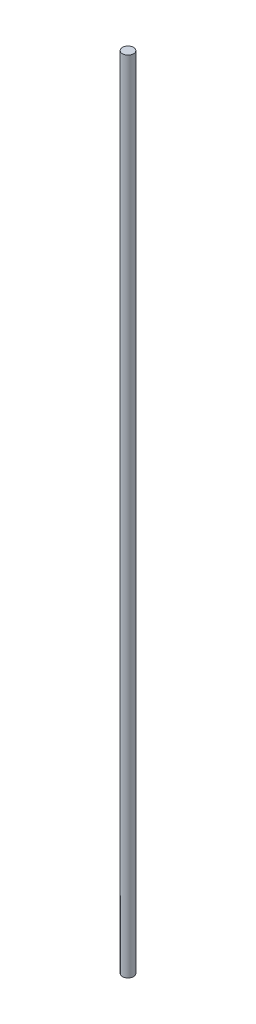
ISO-10303-21;
HEADER;
FILE_DESCRIPTION(('STEP AP214'),'2;1');
FILE_NAME('part.step','',(''),(''),'','','');
FILE_SCHEMA(('AUTOMOTIVE_DESIGN { 1 0 10303 214 1 1 1 1 }'));
ENDSEC;
DATA;
#1=APPLICATION_CONTEXT('core data for automotive mechanical design processes');
#2=APPLICATION_PROTOCOL_DEFINITION('international standard','automotive_design',2000,#1);
#3=PRODUCT_CONTEXT('',#1,'mechanical');
#4=PRODUCT('Part','Part','',(#3));
#5=PRODUCT_RELATED_PRODUCT_CATEGORY('part','',(#4));
#6=PRODUCT_DEFINITION_FORMATION('','',#4);
#7=PRODUCT_DEFINITION_CONTEXT('part definition',#1,'design');
#8=PRODUCT_DEFINITION('design','',#6,#7);
#9=PRODUCT_DEFINITION_SHAPE('','',#8);
#10=(LENGTH_UNIT() NAMED_UNIT(*) SI_UNIT(.MILLI.,.METRE.));
#11=(NAMED_UNIT(*) PLANE_ANGLE_UNIT() SI_UNIT($,.RADIAN.));
#12=(NAMED_UNIT(*) SI_UNIT($,.STERADIAN.) SOLID_ANGLE_UNIT());
#13=UNCERTAINTY_MEASURE_WITH_UNIT(LENGTH_MEASURE(1.E-05),#10,'distance_accuracy_value','');
#14=(GEOMETRIC_REPRESENTATION_CONTEXT(3) GLOBAL_UNCERTAINTY_ASSIGNED_CONTEXT((#13)) GLOBAL_UNIT_ASSIGNED_CONTEXT((#10,
#11,#12)) REPRESENTATION_CONTEXT('',''));
#15=CARTESIAN_POINT('',(0.,0.,0.));
#16=DIRECTION('',(0.,0.,1.));
#17=DIRECTION('',(1.,0.,0.));
#18=AXIS2_PLACEMENT_3D('',#15,#16,#17);
#19=CARTESIAN_POINT('',(0.,-457.2,0.));
#20=DIRECTION('',(0.,1.,0.));
#21=DIRECTION('',(0.,0.,1.));
#22=AXIS2_PLACEMENT_3D('',#19,#20,#21);
#23=CYLINDRICAL_SURFACE('',#22,6.35);
#24=CARTESIAN_POINT('',(0.,-457.2,0.));
#25=DIRECTION('',(0.,1.,0.));
#26=DIRECTION('',(0.,0.,1.));
#27=AXIS2_PLACEMENT_3D('',#24,#25,#26);
#28=CIRCLE('',#27,6.35);
#29=CARTESIAN_POINT('',(0.,-457.2,6.35));
#30=VERTEX_POINT('',#29);
#31=EDGE_CURVE('E10',#30,#30,#28,.T.);
#32=ORIENTED_EDGE('',*,*,#31,.T.);
#33=EDGE_LOOP('',(#32));
#34=FACE_BOUND('',#33,.T.);
#35=CARTESIAN_POINT('',(0.,457.2,0.));
#36=DIRECTION('',(0.,1.,0.));
#37=DIRECTION('',(0.,0.,1.));
#38=AXIS2_PLACEMENT_3D('',#35,#36,#37);
#39=CIRCLE('',#38,6.35);
#40=CARTESIAN_POINT('',(0.,457.2,6.35));
#41=VERTEX_POINT('',#40);
#42=EDGE_CURVE('E37',#41,#41,#39,.T.);
#43=ORIENTED_EDGE('',*,*,#42,.F.);
#44=EDGE_LOOP('',(#43));
#45=FACE_BOUND('',#44,.T.);
#46=ADVANCED_FACE('F31',(#34,#45),#23,.T.);
#47=CARTESIAN_POINT('',(0.,-457.2,0.));
#48=DIRECTION('',(0.,1.,0.));
#49=DIRECTION('',(0.,0.,1.));
#50=AXIS2_PLACEMENT_3D('',#47,#48,#49);
#51=PLANE('',#50);
#52=ORIENTED_EDGE('',*,*,#31,.F.);
#53=EDGE_LOOP('',(#52));
#54=FACE_BOUND('',#53,.T.);
#55=ADVANCED_FACE('F46',(#54),#51,.F.);
#56=CARTESIAN_POINT('',(0.,457.2,0.));
#57=DIRECTION('',(0.,1.,0.));
#58=DIRECTION('',(0.,0.,1.));
#59=AXIS2_PLACEMENT_3D('',#56,#57,#58);
#60=PLANE('',#59);
#61=ORIENTED_EDGE('',*,*,#42,.T.);
#62=EDGE_LOOP('',(#61));
#63=FACE_BOUND('',#62,.T.);
#64=ADVANCED_FACE('F43',(#63),#60,.T.);
#65=CLOSED_SHELL('',(#46,#55,#64));
#66=MANIFOLD_SOLID_BREP('B2',#65);
#67=ADVANCED_BREP_SHAPE_REPRESENTATION('',(#18,#66),#14);
#68=SHAPE_DEFINITION_REPRESENTATION(#9,#67);
ENDSEC;
END-ISO-10303-21;
